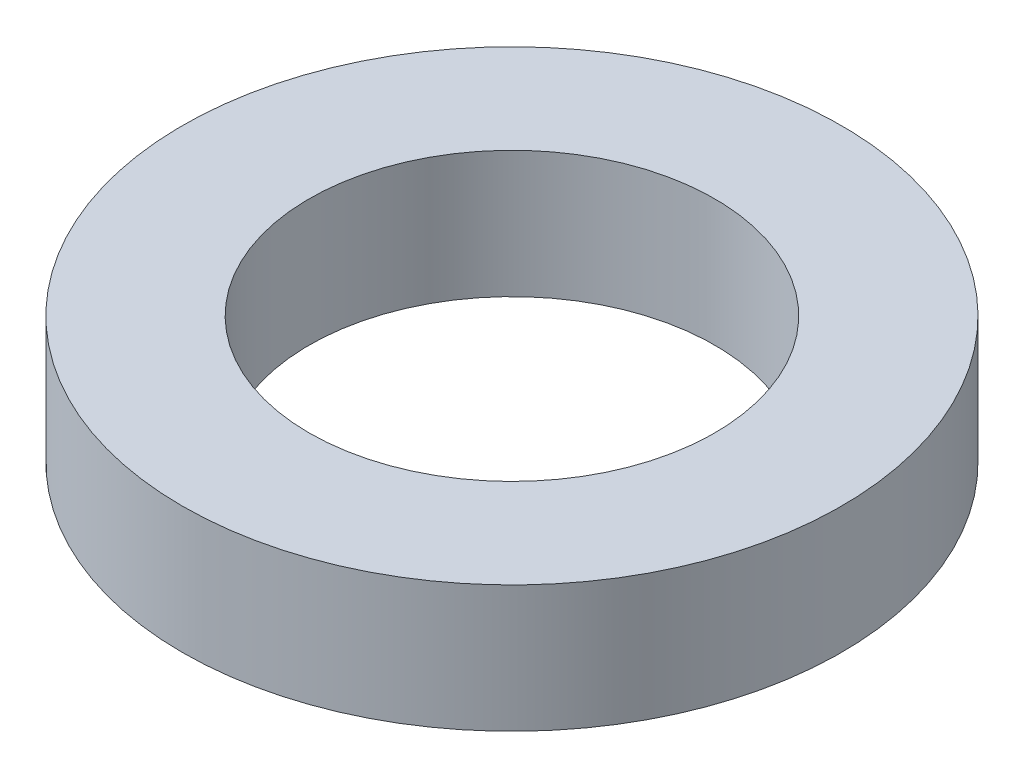
ISO-10303-21;
HEADER;
FILE_DESCRIPTION(('STEP AP214'),'2;1');
FILE_NAME('part.step','',(''),(''),'','','');
FILE_SCHEMA(('AUTOMOTIVE_DESIGN { 1 0 10303 214 1 1 1 1 }'));
ENDSEC;
DATA;
#1=APPLICATION_CONTEXT('core data for automotive mechanical design processes');
#2=APPLICATION_PROTOCOL_DEFINITION('international standard','automotive_design',2000,#1);
#3=PRODUCT_CONTEXT('',#1,'mechanical');
#4=PRODUCT('Part','Part','',(#3));
#5=PRODUCT_RELATED_PRODUCT_CATEGORY('part','',(#4));
#6=PRODUCT_DEFINITION_FORMATION('','',#4);
#7=PRODUCT_DEFINITION_CONTEXT('part definition',#1,'design');
#8=PRODUCT_DEFINITION('design','',#6,#7);
#9=PRODUCT_DEFINITION_SHAPE('','',#8);
#10=(LENGTH_UNIT() NAMED_UNIT(*) SI_UNIT(.MILLI.,.METRE.));
#11=(NAMED_UNIT(*) PLANE_ANGLE_UNIT() SI_UNIT($,.RADIAN.));
#12=(NAMED_UNIT(*) SI_UNIT($,.STERADIAN.) SOLID_ANGLE_UNIT());
#13=UNCERTAINTY_MEASURE_WITH_UNIT(LENGTH_MEASURE(1.E-05),#10,'distance_accuracy_value','');
#14=(GEOMETRIC_REPRESENTATION_CONTEXT(3) GLOBAL_UNCERTAINTY_ASSIGNED_CONTEXT((#13)) GLOBAL_UNIT_ASSIGNED_CONTEXT((#10,
#11,#12)) REPRESENTATION_CONTEXT('',''));
#15=CARTESIAN_POINT('',(0.,0.,0.));
#16=DIRECTION('',(0.,0.,1.));
#17=DIRECTION('',(1.,0.,0.));
#18=AXIS2_PLACEMENT_3D('',#15,#16,#17);
#19=CARTESIAN_POINT('',(0.,25.,0.));
#20=DIRECTION('',(0.,-1.,0.));
#21=DIRECTION('',(0.,0.,-1.));
#22=AXIS2_PLACEMENT_3D('',#19,#20,#21);
#23=CYLINDRICAL_SURFACE('',#22,65.);
#24=CARTESIAN_POINT('',(0.,25.,0.));
#25=DIRECTION('',(0.,1.,0.));
#26=DIRECTION('',(0.,0.,1.));
#27=AXIS2_PLACEMENT_3D('',#24,#25,#26);
#28=CIRCLE('',#27,65.);
#29=CARTESIAN_POINT('',(0.,25.,65.));
#30=VERTEX_POINT('',#29);
#31=EDGE_CURVE('E10',#30,#30,#28,.T.);
#32=ORIENTED_EDGE('',*,*,#31,.F.);
#33=EDGE_LOOP('',(#32));
#34=FACE_BOUND('',#33,.T.);
#35=CARTESIAN_POINT('',(0.,0.,0.));
#36=DIRECTION('',(0.,1.,0.));
#37=DIRECTION('',(0.,0.,1.));
#38=AXIS2_PLACEMENT_3D('',#35,#36,#37);
#39=CIRCLE('',#38,65.);
#40=CARTESIAN_POINT('',(0.,0.,65.));
#41=VERTEX_POINT('',#40);
#42=EDGE_CURVE('E37',#41,#41,#39,.T.);
#43=ORIENTED_EDGE('',*,*,#42,.T.);
#44=EDGE_LOOP('',(#43));
#45=FACE_BOUND('',#44,.T.);
#46=ADVANCED_FACE('F40',(#34,#45),#23,.T.);
#47=CARTESIAN_POINT('',(0.,25.,0.));
#48=DIRECTION('',(0.,1.,0.));
#49=DIRECTION('',(0.,0.,1.));
#50=AXIS2_PLACEMENT_3D('',#47,#48,#49);
#51=PLANE('',#50);
#52=CARTESIAN_POINT('',(0.,25.,0.));
#53=DIRECTION('',(0.,1.,0.));
#54=DIRECTION('',(0.,0.,1.));
#55=AXIS2_PLACEMENT_3D('',#52,#53,#54);
#56=CIRCLE('',#55,40.);
#57=CARTESIAN_POINT('',(0.,25.,40.));
#58=VERTEX_POINT('',#57);
#59=EDGE_CURVE('E50',#58,#58,#56,.T.);
#60=ORIENTED_EDGE('',*,*,#59,.F.);
#61=EDGE_LOOP('',(#60));
#62=FACE_BOUND('',#61,.T.);
#63=ORIENTED_EDGE('',*,*,#31,.T.);
#64=EDGE_LOOP('',(#63));
#65=FACE_BOUND('',#64,.T.);
#66=ADVANCED_FACE('F59',(#62,#65),#51,.T.);
#67=CARTESIAN_POINT('',(0.,0.,0.));
#68=DIRECTION('',(0.,1.,0.));
#69=DIRECTION('',(0.,0.,1.));
#70=AXIS2_PLACEMENT_3D('',#67,#68,#69);
#71=PLANE('',#70);
#72=CARTESIAN_POINT('',(0.,0.,0.));
#73=DIRECTION('',(0.,1.,0.));
#74=DIRECTION('',(0.,0.,1.));
#75=AXIS2_PLACEMENT_3D('',#72,#73,#74);
#76=CIRCLE('',#75,40.);
#77=CARTESIAN_POINT('',(0.,0.,40.));
#78=VERTEX_POINT('',#77);
#79=EDGE_CURVE('E47',#78,#78,#76,.T.);
#80=ORIENTED_EDGE('',*,*,#79,.T.);
#81=EDGE_LOOP('',(#80));
#82=FACE_BOUND('',#81,.T.);
#83=ORIENTED_EDGE('',*,*,#42,.F.);
#84=EDGE_LOOP('',(#83));
#85=FACE_BOUND('',#84,.T.);
#86=ADVANCED_FACE('F58',(#82,#85),#71,.F.);
#87=CARTESIAN_POINT('',(0.,25.,0.));
#88=DIRECTION('',(0.,-1.,0.));
#89=DIRECTION('',(0.,0.,-1.));
#90=AXIS2_PLACEMENT_3D('',#87,#88,#89);
#91=CYLINDRICAL_SURFACE('',#90,40.);
#92=ORIENTED_EDGE('',*,*,#59,.T.);
#93=EDGE_LOOP('',(#92));
#94=FACE_BOUND('',#93,.T.);
#95=ORIENTED_EDGE('',*,*,#79,.F.);
#96=EDGE_LOOP('',(#95));
#97=FACE_BOUND('',#96,.T.);
#98=ADVANCED_FACE('F54',(#94,#97),#91,.F.);
#99=CLOSED_SHELL('',(#46,#66,#86,#98));
#100=MANIFOLD_SOLID_BREP('B2',#99);
#101=ADVANCED_BREP_SHAPE_REPRESENTATION('',(#18,#100),#14);
#102=SHAPE_DEFINITION_REPRESENTATION(#9,#101);
ENDSEC;
END-ISO-10303-21;
